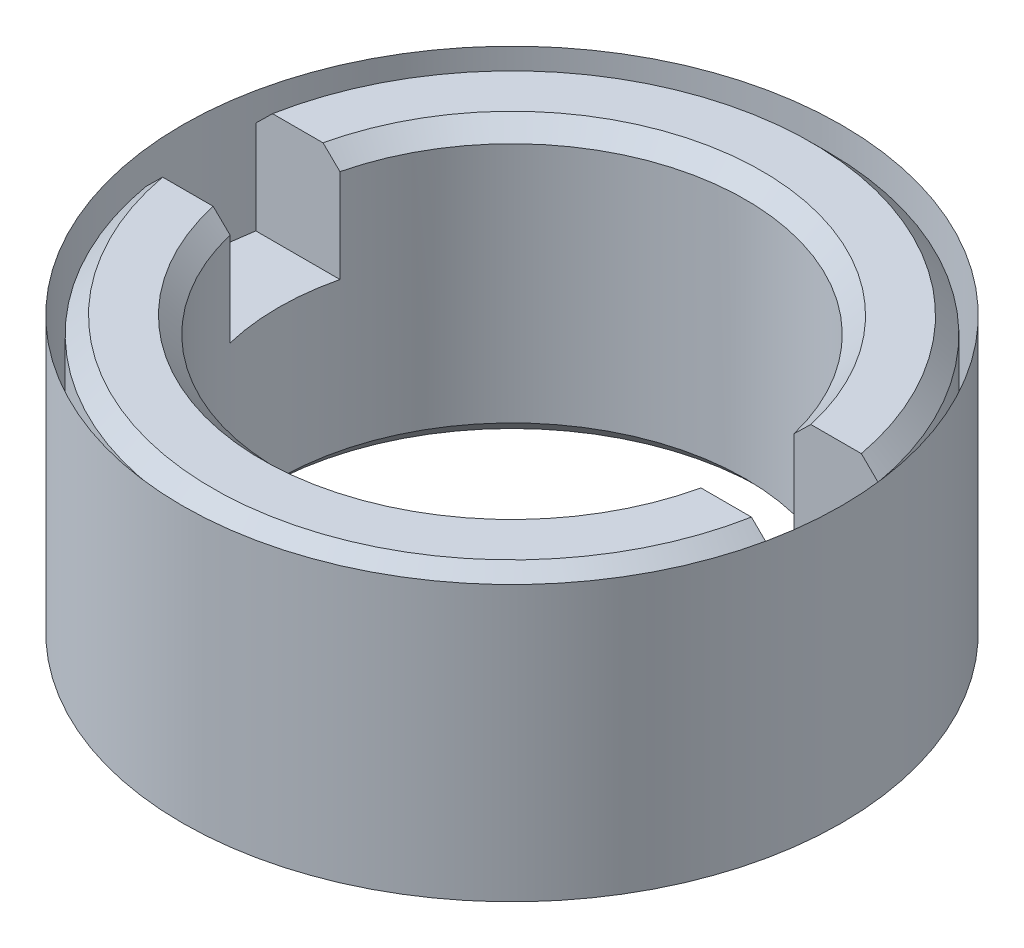
ISO-10303-21;
HEADER;
FILE_DESCRIPTION(('STEP AP214'),'2;1');
FILE_NAME('part.step','',(''),(''),'','','');
FILE_SCHEMA(('AUTOMOTIVE_DESIGN { 1 0 10303 214 1 1 1 1 }'));
ENDSEC;
DATA;
#1=APPLICATION_CONTEXT('core data for automotive mechanical design processes');
#2=APPLICATION_PROTOCOL_DEFINITION('international standard','automotive_design',2000,#1);
#3=PRODUCT_CONTEXT('',#1,'mechanical');
#4=PRODUCT('Part','Part','',(#3));
#5=PRODUCT_RELATED_PRODUCT_CATEGORY('part','',(#4));
#6=PRODUCT_DEFINITION_FORMATION('','',#4);
#7=PRODUCT_DEFINITION_CONTEXT('part definition',#1,'design');
#8=PRODUCT_DEFINITION('design','',#6,#7);
#9=PRODUCT_DEFINITION_SHAPE('','',#8);
#10=(LENGTH_UNIT() NAMED_UNIT(*) SI_UNIT(.MILLI.,.METRE.));
#11=(NAMED_UNIT(*) PLANE_ANGLE_UNIT() SI_UNIT($,.RADIAN.));
#12=(NAMED_UNIT(*) SI_UNIT($,.STERADIAN.) SOLID_ANGLE_UNIT());
#13=UNCERTAINTY_MEASURE_WITH_UNIT(LENGTH_MEASURE(1.E-05),#10,'distance_accuracy_value','');
#14=(GEOMETRIC_REPRESENTATION_CONTEXT(3) GLOBAL_UNCERTAINTY_ASSIGNED_CONTEXT((#13)) GLOBAL_UNIT_ASSIGNED_CONTEXT((#10,
#11,#12)) REPRESENTATION_CONTEXT('',''));
#15=CARTESIAN_POINT('',(0.,0.,0.));
#16=DIRECTION('',(0.,0.,1.));
#17=DIRECTION('',(1.,0.,0.));
#18=AXIS2_PLACEMENT_3D('',#15,#16,#17);
#19=CARTESIAN_POINT('',(0.,4.99999999982492,0.));
#20=DIRECTION('',(0.,1.,0.));
#21=DIRECTION('',(0.,0.,1.));
#22=AXIS2_PLACEMENT_3D('',#19,#20,#21);
#23=CONICAL_SURFACE('',#22,4.54999999982419,0.785398163397448);
#24=CARTESIAN_POINT('',(-4.13067791047438,4.70000000001026,-1.));
#25=CARTESIAN_POINT('',(-4.18206969356389,4.74995228641139,-1.));
#26=CARTESIAN_POINT('',(-4.23343824475705,4.79992842979507,-1.));
#27=CARTESIAN_POINT('',(-4.33612888259486,4.8999284297915,-1.));
#28=CARTESIAN_POINT('',(-4.3874509692402,4.94995228640355,-1.));
#29=CARTESIAN_POINT('',(-4.43874982398988,4.99999999999745,-1.));
#30=B_SPLINE_CURVE_WITH_KNOTS('',3,(#24,#25,#26,#27,#28,#29),.UNSPECIFIED.,.F.,.F.,(4,2,4),(0.,
0.215004852579448,0.430009701993997),.UNSPECIFIED.);
#31=CARTESIAN_POINT('',(-4.13067791047137,4.70000000000732,-0.999999999999952));
#32=VERTEX_POINT('',#31);
#33=CARTESIAN_POINT('',(-4.43874982398885,4.99999999999645,-1.));
#34=VERTEX_POINT('',#33);
#35=EDGE_CURVE('P0_E179',#32,#34,#30,.T.);
#36=ORIENTED_EDGE('',*,*,#35,.F.);
#37=CARTESIAN_POINT('',(0.,4.70000000001392,0.));
#38=DIRECTION('',(0.,1.,0.));
#39=DIRECTION('',(0.,0.,-1.));
#40=AXIS2_PLACEMENT_3D('',#37,#38,#39);
#41=CIRCLE('',#40,4.25000000001319);
#42=CARTESIAN_POINT('',(4.13067791047036,4.70000000001293,-0.999999999999952));
#43=VERTEX_POINT('',#42);
#44=EDGE_CURVE('P0_E177',#43,#32,#41,.T.);
#45=ORIENTED_EDGE('',*,*,#44,.F.);
#46=CARTESIAN_POINT('',(4.43874982398988,4.99999999999745,-1.));
#47=CARTESIAN_POINT('',(4.38745096924049,4.94995228640384,-1.));
#48=CARTESIAN_POINT('',(4.33612888259544,4.89992842979207,-1.));
#49=CARTESIAN_POINT('',(4.23343824475821,4.7999284297962,-1.));
#50=CARTESIAN_POINT('',(4.18206969356534,4.7499522864128,-1.));
#51=CARTESIAN_POINT('',(4.13067791047612,4.70000000001195,-1.));
#52=B_SPLINE_CURVE_WITH_KNOTS('',3,(#46,#47,#48,#49,#50,#51),.UNSPECIFIED.,.F.,.F.,(4,2,4),(0.,
0.215004849413337,0.430009701991573),.UNSPECIFIED.);
#53=CARTESIAN_POINT('',(4.43874982398885,4.99999999999645,-1.));
#54=VERTEX_POINT('',#53);
#55=EDGE_CURVE('P0_E20',#54,#43,#52,.T.);
#56=ORIENTED_EDGE('',*,*,#55,.F.);
#57=CARTESIAN_POINT('',(0.,4.99999999999545,0.));
#58=DIRECTION('',(0.,1.,0.));
#59=DIRECTION('',(0.,0.,1.));
#60=AXIS2_PLACEMENT_3D('',#57,#58,#59);
#61=CIRCLE('',#60,4.54999999999472);
#62=EDGE_CURVE('P0_E167',#34,#54,#61,.F.);
#63=ORIENTED_EDGE('',*,*,#62,.F.);
#64=EDGE_LOOP('',(#36,#45,#56,#63));
#65=FACE_BOUND('',#64,.T.);
#66=ADVANCED_FACE('P0_F16',(#65),#23,.F.);
#67=CARTESIAN_POINT('',(0.,0.,0.));
#68=DIRECTION('',(0.,1.,0.));
#69=DIRECTION('',(0.,0.,1.));
#70=AXIS2_PLACEMENT_3D('',#67,#68,#69);
#71=CYLINDRICAL_SURFACE('',#70,4.25);
#72=CARTESIAN_POINT('',(0.,0.300000000038381,0.));
#73=DIRECTION('',(0.,-1.,0.));
#74=DIRECTION('',(0.,0.,-1.));
#75=AXIS2_PLACEMENT_3D('',#72,#73,#74);
#76=CIRCLE('',#75,4.25000000001319);
#77=CARTESIAN_POINT('',(0.,0.300000000038381,-4.25000000001319));
#78=VERTEX_POINT('',#77);
#79=EDGE_CURVE('P0_E174',#78,#78,#76,.T.);
#80=ORIENTED_EDGE('',*,*,#79,.T.);
#81=EDGE_LOOP('',(#80));
#82=FACE_BOUND('',#81,.T.);
#83=CARTESIAN_POINT('',(0.,4.70000000001392,0.));
#84=DIRECTION('',(0.,1.,0.));
#85=DIRECTION('',(0.,0.,-1.));
#86=AXIS2_PLACEMENT_3D('',#83,#84,#85);
#87=CIRCLE('',#86,4.25000000001319);
#88=CARTESIAN_POINT('',(-4.13067791047036,4.70000000001293,0.999999999999951));
#89=VERTEX_POINT('',#88);
#90=CARTESIAN_POINT('',(4.13067791047137,4.70000000000732,0.999999999999952));
#91=VERTEX_POINT('',#90);
#92=EDGE_CURVE('P0_E168',#89,#91,#87,.T.);
#93=ORIENTED_EDGE('',*,*,#92,.T.);
#94=DIRECTION('',(0.,1.,0.));
#95=VECTOR('',#94,1.);
#96=CARTESIAN_POINT('',(4.1306779104646,0.,0.999999999999904));
#97=LINE('',#96,#95);
#98=CARTESIAN_POINT('',(4.13067791046459,3.,0.999999999999952));
#99=VERTEX_POINT('',#98);
#100=EDGE_CURVE('P0_E119',#99,#91,#97,.T.);
#101=ORIENTED_EDGE('',*,*,#100,.F.);
#102=CARTESIAN_POINT('',(0.,3.,0.));
#103=DIRECTION('',(0.,1.,0.));
#104=DIRECTION('',(0.,0.,1.));
#105=AXIS2_PLACEMENT_3D('',#102,#103,#104);
#106=CIRCLE('',#105,4.25);
#107=CARTESIAN_POINT('',(4.13067791046459,3.,-0.999999999999952));
#108=VERTEX_POINT('',#107);
#109=EDGE_CURVE('P0_E112',#108,#99,#106,.F.);
#110=ORIENTED_EDGE('',*,*,#109,.F.);
#111=DIRECTION('',(0.,1.,0.));
#112=VECTOR('',#111,1.);
#113=CARTESIAN_POINT('',(4.1306779104646,0.,-0.999999999999903));
#114=LINE('',#113,#112);
#115=EDGE_CURVE('P0_E117',#43,#108,#114,.F.);
#116=ORIENTED_EDGE('',*,*,#115,.F.);
#117=ORIENTED_EDGE('',*,*,#44,.T.);
#118=DIRECTION('',(0.,1.,0.));
#119=VECTOR('',#118,1.);
#120=CARTESIAN_POINT('',(-4.1306779104646,0.,-0.999999999999904));
#121=LINE('',#120,#119);
#122=CARTESIAN_POINT('',(-4.13067791046459,3.,-0.999999999999952));
#123=VERTEX_POINT('',#122);
#124=EDGE_CURVE('P0_E131',#123,#32,#121,.T.);
#125=ORIENTED_EDGE('',*,*,#124,.F.);
#126=CARTESIAN_POINT('',(0.,3.,0.));
#127=DIRECTION('',(0.,1.,0.));
#128=DIRECTION('',(0.,0.,1.));
#129=AXIS2_PLACEMENT_3D('',#126,#127,#128);
#130=CIRCLE('',#129,4.25);
#131=CARTESIAN_POINT('',(-4.13067791046459,3.,0.999999999999951));
#132=VERTEX_POINT('',#131);
#133=EDGE_CURVE('P0_E106',#132,#123,#130,.F.);
#134=ORIENTED_EDGE('',*,*,#133,.F.);
#135=DIRECTION('',(0.,1.,0.));
#136=VECTOR('',#135,1.);
#137=CARTESIAN_POINT('',(-4.1306779104646,0.,0.999999999999903));
#138=LINE('',#137,#136);
#139=EDGE_CURVE('P0_E172',#89,#132,#138,.F.);
#140=ORIENTED_EDGE('',*,*,#139,.F.);
#141=EDGE_LOOP('',(#93,#101,#110,#116,#117,#125,#134,#140));
#142=FACE_BOUND('',#141,.T.);
#143=ADVANCED_FACE('P0_F115',(#82,#142),#71,.F.);
#144=CARTESIAN_POINT('',(0.,0.,0.));
#145=DIRECTION('',(0.,-1.,0.));
#146=DIRECTION('',(0.,0.,-1.));
#147=AXIS2_PLACEMENT_3D('',#144,#145,#146);
#148=CONICAL_SURFACE('',#147,4.55000000005157,0.785398163397448);
#149=ORIENTED_EDGE('',*,*,#79,.F.);
#150=EDGE_LOOP('',(#149));
#151=FACE_BOUND('',#150,.T.);
#152=CARTESIAN_POINT('',(0.,0.,0.));
#153=DIRECTION('',(0.,-1.,0.));
#154=DIRECTION('',(0.,0.,-1.));
#155=AXIS2_PLACEMENT_3D('',#152,#153,#154);
#156=CIRCLE('',#155,4.55000000005157);
#157=CARTESIAN_POINT('',(0.,0.,-4.55000000005157));
#158=VERTEX_POINT('',#157);
#159=EDGE_CURVE('P0_E218',#158,#158,#156,.T.);
#160=ORIENTED_EDGE('',*,*,#159,.T.);
#161=EDGE_LOOP('',(#160));
#162=FACE_BOUND('',#161,.T.);
#163=ADVANCED_FACE('P0_F236',(#151,#162),#148,.F.);
#164=CARTESIAN_POINT('',(0.,5.,0.));
#165=DIRECTION('',(0.,1.,0.));
#166=DIRECTION('',(0.,0.,1.));
#167=AXIS2_PLACEMENT_3D('',#164,#165,#166);
#168=PLANE('',#167);
#169=CARTESIAN_POINT('',(0.,4.99999999999545,0.));
#170=DIRECTION('',(0.,-1.,0.));
#171=DIRECTION('',(0.,0.,-1.));
#172=AXIS2_PLACEMENT_3D('',#169,#170,#171);
#173=CIRCLE('',#172,5.45000000005302);
#174=CARTESIAN_POINT('',(-5.35747141854748,4.99999999999773,-1.));
#175=VERTEX_POINT('',#174);
#176=CARTESIAN_POINT('',(5.35747141854748,4.99999999999773,-1.));
#177=VERTEX_POINT('',#176);
#178=EDGE_CURVE('P0_E282',#175,#177,#173,.T.);
#179=ORIENTED_EDGE('',*,*,#178,.F.);
#180=DIRECTION('',(1.,0.,0.));
#181=VECTOR('',#180,1.);
#182=CARTESIAN_POINT('',(0.,5.,-1.));
#183=LINE('',#182,#181);
#184=EDGE_CURVE('P0_E161',#175,#34,#183,.T.);
#185=ORIENTED_EDGE('',*,*,#184,.T.);
#186=ORIENTED_EDGE('',*,*,#62,.T.);
#187=DIRECTION('',(1.,0.,0.));
#188=VECTOR('',#187,1.);
#189=CARTESIAN_POINT('',(0.,5.,-1.));
#190=LINE('',#189,#188);
#191=EDGE_CURVE('P0_E165',#54,#177,#190,.T.);
#192=ORIENTED_EDGE('',*,*,#191,.T.);
#193=EDGE_LOOP('',(#179,#185,#186,#192));
#194=FACE_BOUND('',#193,.T.);
#195=ADVANCED_FACE('P0_F230',(#194),#168,.T.);
#196=CARTESIAN_POINT('',(0.,4.99999999982492,0.));
#197=DIRECTION('',(0.,1.,0.));
#198=DIRECTION('',(0.,0.,1.));
#199=AXIS2_PLACEMENT_3D('',#196,#197,#198);
#200=CONICAL_SURFACE('',#199,4.54999999982419,0.785398163397448);
#201=CARTESIAN_POINT('',(4.13067791047438,4.70000000001026,1.));
#202=CARTESIAN_POINT('',(4.18206969356389,4.74995228641139,1.));
#203=CARTESIAN_POINT('',(4.23343824475705,4.79992842979507,1.));
#204=CARTESIAN_POINT('',(4.33612888259486,4.8999284297915,1.));
#205=CARTESIAN_POINT('',(4.3874509692402,4.94995228640355,1.));
#206=CARTESIAN_POINT('',(4.43874982398988,4.99999999999745,1.));
#207=B_SPLINE_CURVE_WITH_KNOTS('',3,(#201,#202,#203,#204,#205,#206),.UNSPECIFIED.,.F.,.F.,(4,2,
4),(0.,0.215004852579449,0.430009701993998),.UNSPECIFIED.);
#208=CARTESIAN_POINT('',(4.43874982398885,4.99999999999645,1.));
#209=VERTEX_POINT('',#208);
#210=EDGE_CURVE('P0_E170',#91,#209,#207,.T.);
#211=ORIENTED_EDGE('',*,*,#210,.F.);
#212=ORIENTED_EDGE('',*,*,#92,.F.);
#213=CARTESIAN_POINT('',(-4.43874982398988,4.99999999999745,1.));
#214=CARTESIAN_POINT('',(-4.38745096924049,4.94995228640384,1.));
#215=CARTESIAN_POINT('',(-4.33612888259544,4.89992842979207,1.));
#216=CARTESIAN_POINT('',(-4.23343824475821,4.7999284297962,1.));
#217=CARTESIAN_POINT('',(-4.18206969356534,4.7499522864128,1.));
#218=CARTESIAN_POINT('',(-4.13067791047612,4.70000000001195,1.));
#219=B_SPLINE_CURVE_WITH_KNOTS('',3,(#213,#214,#215,#216,#217,#218),.UNSPECIFIED.,.F.,.F.,(4,2,
4),(0.,0.215004849413337,0.430009701991573),.UNSPECIFIED.);
#220=CARTESIAN_POINT('',(-4.43874982398885,4.99999999999645,1.));
#221=VERTEX_POINT('',#220);
#222=EDGE_CURVE('P0_E164',#221,#89,#219,.T.);
#223=ORIENTED_EDGE('',*,*,#222,.F.);
#224=CARTESIAN_POINT('',(0.,4.99999999999545,0.));
#225=DIRECTION('',(0.,1.,0.));
#226=DIRECTION('',(0.,0.,1.));
#227=AXIS2_PLACEMENT_3D('',#224,#225,#226);
#228=CIRCLE('',#227,4.54999999999472);
#229=EDGE_CURVE('P0_E157',#209,#221,#228,.F.);
#230=ORIENTED_EDGE('',*,*,#229,.F.);
#231=EDGE_LOOP('',(#211,#212,#223,#230));
#232=FACE_BOUND('',#231,.T.);
#233=ADVANCED_FACE('P0_F224',(#232),#200,.F.);
#234=CARTESIAN_POINT('',(0.,0.,0.));
#235=DIRECTION('',(0.,1.,0.));
#236=DIRECTION('',(0.,0.,1.));
#237=AXIS2_PLACEMENT_3D('',#234,#235,#236);
#238=PLANE('',#237);
#239=ORIENTED_EDGE('',*,*,#159,.F.);
#240=EDGE_LOOP('',(#239));
#241=FACE_BOUND('',#240,.T.);
#242=CARTESIAN_POINT('',(0.,0.,0.));
#243=DIRECTION('',(0.,1.,0.));
#244=DIRECTION('',(0.,0.,1.));
#245=AXIS2_PLACEMENT_3D('',#242,#243,#244);
#246=CIRCLE('',#245,5.44999999993932);
#247=CARTESIAN_POINT('',(0.,0.,5.44999999993931));
#248=VERTEX_POINT('',#247);
#249=EDGE_CURVE('P0_E153',#248,#248,#246,.T.);
#250=ORIENTED_EDGE('',*,*,#249,.F.);
#251=EDGE_LOOP('',(#250));
#252=FACE_BOUND('',#251,.T.);
#253=ADVANCED_FACE('P0_F229',(#241,#252),#238,.F.);
#254=CARTESIAN_POINT('',(0.,4.70000000018445,0.));
#255=DIRECTION('',(0.,-1.,0.));
#256=DIRECTION('',(0.,0.,-1.));
#257=AXIS2_PLACEMENT_3D('',#254,#255,#256);
#258=CONICAL_SURFACE('',#257,5.74999999986403,0.785398163397448);
#259=CARTESIAN_POINT('',(0.,4.7,0.));
#260=DIRECTION('',(0.,1.,0.));
#261=DIRECTION('',(0.,0.,1.));
#262=AXIS2_PLACEMENT_3D('',#259,#260,#261);
#263=CIRCLE('',#262,5.75);
#264=CARTESIAN_POINT('',(-5.66237582646517,4.70000000001231,-1.00000000000001));
#265=VERTEX_POINT('',#264);
#266=CARTESIAN_POINT('',(5.66237582646518,4.70000000001231,-1.00000000000001));
#267=VERTEX_POINT('',#266);
#268=EDGE_CURVE('P0_E142',#265,#267,#263,.F.);
#269=ORIENTED_EDGE('',*,*,#268,.F.);
#270=CARTESIAN_POINT('',(-5.66237582647728,4.70000000002463,-1.));
#271=CARTESIAN_POINT('',(-5.61158049596436,4.75002243151758,-1.));
#272=CARTESIAN_POINT('',(-5.56077413007846,4.80003364723098,-1.));
#273=CARTESIAN_POINT('',(-5.45913932742806,4.90003364722915,-1.));
#274=CARTESIAN_POINT('',(-5.4083108906635,4.95002243151385,-1.));
#275=CARTESIAN_POINT('',(-5.35747141852591,5.00000000001894,-1.));
#276=B_SPLINE_CURVE_WITH_KNOTS('',3,(#270,#271,#272,#273,#274,#275),.UNSPECIFIED.,.F.,.F.,(4,2,
4),(0.,0.213873038518141,0.427746077594405),.UNSPECIFIED.);
#277=EDGE_CURVE('P0_E156',#265,#175,#276,.T.);
#278=ORIENTED_EDGE('',*,*,#277,.T.);
#279=ORIENTED_EDGE('',*,*,#178,.T.);
#280=CARTESIAN_POINT('',(5.35747141852591,5.00000000001894,-1.));
#281=CARTESIAN_POINT('',(5.40831089066351,4.95002243151385,-1.));
#282=CARTESIAN_POINT('',(5.45913932742806,4.90003364722914,-1.));
#283=CARTESIAN_POINT('',(5.56077413007847,4.80003364723097,-1.));
#284=CARTESIAN_POINT('',(5.61158049596438,4.75002243151757,-1.));
#285=CARTESIAN_POINT('',(5.6623758264773,4.70000000002461,-1.));
#286=B_SPLINE_CURVE_WITH_KNOTS('',3,(#280,#281,#282,#283,#284,#285),.UNSPECIFIED.,.F.,.F.,(4,2,
4),(0.,0.213873039076274,0.427746077594427),.UNSPECIFIED.);
#287=EDGE_CURVE('P0_E280',#177,#267,#286,.T.);
#288=ORIENTED_EDGE('',*,*,#287,.T.);
#289=EDGE_LOOP('',(#269,#278,#279,#288));
#290=FACE_BOUND('',#289,.T.);
#291=ADVANCED_FACE('P0_F295',(#290),#258,.T.);
#292=CARTESIAN_POINT('',(6.959756831924,5.,-1.));
#293=DIRECTION('',(0.,0.,-1.));
#294=DIRECTION('',(-1.,0.,0.));
#295=AXIS2_PLACEMENT_3D('',#292,#293,#294);
#296=PLANE('',#295);
#297=ORIENTED_EDGE('',*,*,#115,.T.);
#298=DIRECTION('',(1.,0.,0.));
#299=VECTOR('',#298,1.);
#300=CARTESIAN_POINT('',(0.,3.,-1.));
#301=LINE('',#300,#299);
#302=CARTESIAN_POINT('',(5.66237582645306,3.,-1.00000000000001));
#303=VERTEX_POINT('',#302);
#304=EDGE_CURVE('P0_E128',#303,#108,#301,.F.);
#305=ORIENTED_EDGE('',*,*,#304,.F.);
#306=DIRECTION('',(0.,1.,0.));
#307=VECTOR('',#306,1.);
#308=CARTESIAN_POINT('',(5.66237582645306,0.,-1.00000000000001));
#309=LINE('',#308,#307);
#310=EDGE_CURVE('P0_E137',#267,#303,#309,.F.);
#311=ORIENTED_EDGE('',*,*,#310,.F.);
#312=ORIENTED_EDGE('',*,*,#287,.F.);
#313=ORIENTED_EDGE('',*,*,#191,.F.);
#314=ORIENTED_EDGE('',*,*,#55,.T.);
#315=EDGE_LOOP('',(#297,#305,#311,#312,#313,#314));
#316=FACE_BOUND('',#315,.T.);
#317=ADVANCED_FACE('P0_F126',(#316),#296,.F.);
#318=CARTESIAN_POINT('',(0.,5.,0.));
#319=DIRECTION('',(0.,1.,0.));
#320=DIRECTION('',(0.,0.,1.));
#321=AXIS2_PLACEMENT_3D('',#318,#319,#320);
#322=PLANE('',#321);
#323=ORIENTED_EDGE('',*,*,#229,.T.);
#324=DIRECTION('',(1.,0.,0.));
#325=VECTOR('',#324,1.);
#326=CARTESIAN_POINT('',(0.,5.,1.));
#327=LINE('',#326,#325);
#328=CARTESIAN_POINT('',(-5.35747141854747,4.99999999999773,1.));
#329=VERTEX_POINT('',#328);
#330=EDGE_CURVE('P0_E155',#221,#329,#327,.F.);
#331=ORIENTED_EDGE('',*,*,#330,.T.);
#332=CARTESIAN_POINT('',(0.,4.99999999999545,0.));
#333=DIRECTION('',(0.,-1.,0.));
#334=DIRECTION('',(0.,0.,-1.));
#335=AXIS2_PLACEMENT_3D('',#332,#333,#334);
#336=CIRCLE('',#335,5.45000000005301);
#337=CARTESIAN_POINT('',(5.35747141854747,4.99999999999773,1.));
#338=VERTEX_POINT('',#337);
#339=EDGE_CURVE('P0_E272',#338,#329,#336,.T.);
#340=ORIENTED_EDGE('',*,*,#339,.F.);
#341=DIRECTION('',(1.,0.,0.));
#342=VECTOR('',#341,1.);
#343=CARTESIAN_POINT('',(-7.012884746671,5.,1.));
#344=LINE('',#343,#342);
#345=EDGE_CURVE('P0_E136',#338,#209,#344,.F.);
#346=ORIENTED_EDGE('',*,*,#345,.T.);
#347=EDGE_LOOP('',(#323,#331,#340,#346));
#348=FACE_BOUND('',#347,.T.);
#349=ADVANCED_FACE('P0_F278',(#348),#322,.T.);
#350=CARTESIAN_POINT('',(6.959756831924,5.,-1.));
#351=DIRECTION('',(0.,0.,-1.));
#352=DIRECTION('',(-1.,0.,0.));
#353=AXIS2_PLACEMENT_3D('',#350,#351,#352);
#354=PLANE('',#353);
#355=DIRECTION('',(0.,1.,0.));
#356=VECTOR('',#355,1.);
#357=CARTESIAN_POINT('',(-5.66237582645306,0.,-1.00000000000001));
#358=LINE('',#357,#356);
#359=CARTESIAN_POINT('',(-5.66237582645306,3.,-1.00000000000001));
#360=VERTEX_POINT('',#359);
#361=EDGE_CURVE('P0_E151',#360,#265,#358,.T.);
#362=ORIENTED_EDGE('',*,*,#361,.F.);
#363=DIRECTION('',(1.,0.,0.));
#364=VECTOR('',#363,1.);
#365=CARTESIAN_POINT('',(0.,3.,-1.));
#366=LINE('',#365,#364);
#367=EDGE_CURVE('P0_E150',#123,#360,#366,.F.);
#368=ORIENTED_EDGE('',*,*,#367,.F.);
#369=ORIENTED_EDGE('',*,*,#124,.T.);
#370=ORIENTED_EDGE('',*,*,#35,.T.);
#371=ORIENTED_EDGE('',*,*,#184,.F.);
#372=ORIENTED_EDGE('',*,*,#277,.F.);
#373=EDGE_LOOP('',(#362,#368,#369,#370,#371,#372));
#374=FACE_BOUND('',#373,.T.);
#375=ADVANCED_FACE('P0_F310',(#374),#354,.F.);
#376=CARTESIAN_POINT('',(0.,0.299999999924694,0.));
#377=DIRECTION('',(0.,1.,0.));
#378=DIRECTION('',(0.,0.,1.));
#379=AXIS2_PLACEMENT_3D('',#376,#377,#378);
#380=CONICAL_SURFACE('',#379,5.74999999986402,0.785398163397448);
#381=CARTESIAN_POINT('',(0.,0.3,0.));
#382=DIRECTION('',(0.,1.,0.));
#383=DIRECTION('',(0.,0.,1.));
#384=AXIS2_PLACEMENT_3D('',#381,#382,#383);
#385=CIRCLE('',#384,5.75);
#386=CARTESIAN_POINT('',(0.,0.3,5.75));
#387=VERTEX_POINT('',#386);
#388=EDGE_CURVE('P0_E147',#387,#387,#385,.T.);
#389=ORIENTED_EDGE('',*,*,#388,.F.);
#390=EDGE_LOOP('',(#389));
#391=FACE_BOUND('',#390,.T.);
#392=ORIENTED_EDGE('',*,*,#249,.T.);
#393=EDGE_LOOP('',(#392));
#394=FACE_BOUND('',#393,.T.);
#395=ADVANCED_FACE('P0_F319',(#391,#394),#380,.T.);
#396=CARTESIAN_POINT('',(0.,3.,0.));
#397=DIRECTION('',(0.,1.,0.));
#398=DIRECTION('',(0.,0.,1.));
#399=AXIS2_PLACEMENT_3D('',#396,#397,#398);
#400=PLANE('',#399);
#401=CARTESIAN_POINT('',(0.,3.,0.));
#402=DIRECTION('',(0.,1.,0.));
#403=DIRECTION('',(0.,0.,1.));
#404=AXIS2_PLACEMENT_3D('',#401,#402,#403);
#405=CIRCLE('',#404,5.75);
#406=CARTESIAN_POINT('',(5.66237582645306,3.,1.00000000000001));
#407=VERTEX_POINT('',#406);
#408=EDGE_CURVE('P0_E135',#303,#407,#405,.F.);
#409=ORIENTED_EDGE('',*,*,#408,.F.);
#410=ORIENTED_EDGE('',*,*,#304,.T.);
#411=ORIENTED_EDGE('',*,*,#109,.T.);
#412=DIRECTION('',(1.,0.,0.));
#413=VECTOR('',#412,1.);
#414=CARTESIAN_POINT('',(-7.012884746671,3.,1.));
#415=LINE('',#414,#413);
#416=EDGE_CURVE('P0_E140',#99,#407,#415,.T.);
#417=ORIENTED_EDGE('',*,*,#416,.T.);
#418=EDGE_LOOP('',(#409,#410,#411,#417));
#419=FACE_BOUND('',#418,.T.);
#420=ADVANCED_FACE('P0_F133',(#419),#400,.T.);
#421=CARTESIAN_POINT('',(-7.012884746671,5.,1.));
#422=DIRECTION('',(0.,0.,1.));
#423=DIRECTION('',(1.,0.,0.));
#424=AXIS2_PLACEMENT_3D('',#421,#422,#423);
#425=PLANE('',#424);
#426=DIRECTION('',(0.,1.,0.));
#427=VECTOR('',#426,1.);
#428=CARTESIAN_POINT('',(5.66237582645306,0.,1.00000000000001));
#429=LINE('',#428,#427);
#430=CARTESIAN_POINT('',(5.66237582646065,4.70000000001676,1.00000000000001));
#431=VERTEX_POINT('',#430);
#432=EDGE_CURVE('P0_E182',#407,#431,#429,.T.);
#433=ORIENTED_EDGE('',*,*,#432,.F.);
#434=ORIENTED_EDGE('',*,*,#416,.F.);
#435=ORIENTED_EDGE('',*,*,#100,.T.);
#436=ORIENTED_EDGE('',*,*,#210,.T.);
#437=ORIENTED_EDGE('',*,*,#345,.F.);
#438=CARTESIAN_POINT('',(5.66237582646824,4.70000000003352,1.));
#439=CARTESIAN_POINT('',(5.61158049595918,4.75002243152268,1.));
#440=CARTESIAN_POINT('',(5.56077413007713,4.80003364723228,1.));
#441=CARTESIAN_POINT('',(5.45913932743445,4.90003364722284,1.));
#442=CARTESIAN_POINT('',(5.40831089067376,4.95002243150375,1.));
#443=CARTESIAN_POINT('',(5.35747141854002,5.00000000000505,1.));
#444=B_SPLINE_CURVE_WITH_KNOTS('',3,(#438,#439,#440,#441,#442,#443),.UNSPECIFIED.,.F.,.F.,(4,2,
4),(0.,0.213873038501898,0.427746077561919),.UNSPECIFIED.);
#445=EDGE_CURVE('P0_E190',#431,#338,#444,.T.);
#446=ORIENTED_EDGE('',*,*,#445,.F.);
#447=EDGE_LOOP('',(#433,#434,#435,#436,#437,#446));
#448=FACE_BOUND('',#447,.T.);
#449=ADVANCED_FACE('P0_F202',(#448),#425,.F.);
#450=CARTESIAN_POINT('',(0.,4.70000000018445,0.));
#451=DIRECTION('',(0.,-1.,0.));
#452=DIRECTION('',(0.,0.,-1.));
#453=AXIS2_PLACEMENT_3D('',#450,#451,#452);
#454=CONICAL_SURFACE('',#453,5.74999999986402,0.785398163397448);
#455=CARTESIAN_POINT('',(0.,4.7,0.));
#456=DIRECTION('',(0.,1.,0.));
#457=DIRECTION('',(0.,0.,1.));
#458=AXIS2_PLACEMENT_3D('',#455,#456,#457);
#459=CIRCLE('',#458,5.75);
#460=CARTESIAN_POINT('',(-5.66237582646517,4.7000000000123,1.));
#461=VERTEX_POINT('',#460);
#462=EDGE_CURVE('P0_E262',#431,#461,#459,.F.);
#463=ORIENTED_EDGE('',*,*,#462,.F.);
#464=ORIENTED_EDGE('',*,*,#445,.T.);
#465=ORIENTED_EDGE('',*,*,#339,.T.);
#466=CARTESIAN_POINT('',(-5.3574714185259,5.00000000001893,1.));
#467=CARTESIAN_POINT('',(-5.4083108906635,4.95002243151384,1.));
#468=CARTESIAN_POINT('',(-5.45913932742805,4.90003364722913,1.));
#469=CARTESIAN_POINT('',(-5.56077413007846,4.80003364723097,1.));
#470=CARTESIAN_POINT('',(-5.61158049596437,4.75002243151756,1.));
#471=CARTESIAN_POINT('',(-5.66237582647729,4.7000000000246,1.));
#472=B_SPLINE_CURVE_WITH_KNOTS('',3,(#466,#467,#468,#469,#470,#471),.UNSPECIFIED.,.F.,.F.,(4,2,
4),(0.,0.213873039076276,0.42774607759443),.UNSPECIFIED.);
#473=EDGE_CURVE('P0_E183',#329,#461,#472,.T.);
#474=ORIENTED_EDGE('',*,*,#473,.T.);
#475=EDGE_LOOP('',(#463,#464,#465,#474));
#476=FACE_BOUND('',#475,.T.);
#477=ADVANCED_FACE('P0_F199',(#476),#454,.T.);
#478=CARTESIAN_POINT('',(-7.012884746671,5.,1.));
#479=DIRECTION('',(0.,0.,1.));
#480=DIRECTION('',(1.,0.,0.));
#481=AXIS2_PLACEMENT_3D('',#478,#479,#480);
#482=PLANE('',#481);
#483=ORIENTED_EDGE('',*,*,#139,.T.);
#484=DIRECTION('',(1.,0.,0.));
#485=VECTOR('',#484,1.);
#486=CARTESIAN_POINT('',(0.,3.,1.));
#487=LINE('',#486,#485);
#488=CARTESIAN_POINT('',(-5.66237582645306,3.,1.));
#489=VERTEX_POINT('',#488);
#490=EDGE_CURVE('P0_E39',#489,#132,#487,.T.);
#491=ORIENTED_EDGE('',*,*,#490,.F.);
#492=DIRECTION('',(0.,1.,0.));
#493=VECTOR('',#492,1.);
#494=CARTESIAN_POINT('',(-5.66237582645306,0.,1.00000000000001));
#495=LINE('',#494,#493);
#496=EDGE_CURVE('P0_E30',#461,#489,#495,.F.);
#497=ORIENTED_EDGE('',*,*,#496,.F.);
#498=ORIENTED_EDGE('',*,*,#473,.F.);
#499=ORIENTED_EDGE('',*,*,#330,.F.);
#500=ORIENTED_EDGE('',*,*,#222,.T.);
#501=EDGE_LOOP('',(#483,#491,#497,#498,#499,#500));
#502=FACE_BOUND('',#501,.T.);
#503=ADVANCED_FACE('P0_F196',(#502),#482,.F.);
#504=CARTESIAN_POINT('',(0.,3.,0.));
#505=DIRECTION('',(0.,1.,0.));
#506=DIRECTION('',(0.,0.,1.));
#507=AXIS2_PLACEMENT_3D('',#504,#505,#506);
#508=PLANE('',#507);
#509=ORIENTED_EDGE('',*,*,#367,.T.);
#510=CARTESIAN_POINT('',(0.,3.,0.));
#511=DIRECTION('',(0.,1.,0.));
#512=DIRECTION('',(0.,0.,1.));
#513=AXIS2_PLACEMENT_3D('',#510,#511,#512);
#514=CIRCLE('',#513,5.75);
#515=EDGE_CURVE('P0_E11',#489,#360,#514,.F.);
#516=ORIENTED_EDGE('',*,*,#515,.F.);
#517=ORIENTED_EDGE('',*,*,#490,.T.);
#518=ORIENTED_EDGE('',*,*,#133,.T.);
#519=EDGE_LOOP('',(#509,#516,#517,#518));
#520=FACE_BOUND('',#519,.T.);
#521=ADVANCED_FACE('P0_F249',(#520),#508,.T.);
#522=CARTESIAN_POINT('',(0.,0.,0.));
#523=DIRECTION('',(0.,1.,0.));
#524=DIRECTION('',(0.,0.,1.));
#525=AXIS2_PLACEMENT_3D('',#522,#523,#524);
#526=CYLINDRICAL_SURFACE('',#525,5.75);
#527=ORIENTED_EDGE('',*,*,#388,.T.);
#528=EDGE_LOOP('',(#527));
#529=FACE_BOUND('',#528,.T.);
#530=ORIENTED_EDGE('',*,*,#496,.T.);
#531=ORIENTED_EDGE('',*,*,#515,.T.);
#532=ORIENTED_EDGE('',*,*,#361,.T.);
#533=ORIENTED_EDGE('',*,*,#268,.T.);
#534=ORIENTED_EDGE('',*,*,#310,.T.);
#535=ORIENTED_EDGE('',*,*,#408,.T.);
#536=ORIENTED_EDGE('',*,*,#432,.T.);
#537=ORIENTED_EDGE('',*,*,#462,.T.);
#538=EDGE_LOOP('',(#530,#531,#532,#533,#534,#535,#536,#537));
#539=FACE_BOUND('',#538,.T.);
#540=ADVANCED_FACE('P0_F247',(#529,#539),#526,.T.);
#541=CLOSED_SHELL('',(#66,#143,#163,#195,#233,#253,#291,#317,#349,#375,#395,#420,#449,#477,#503,
#521,#540));
#542=MANIFOLD_SOLID_BREP('P0_B1',#541);
#543=CARTESIAN_POINT('',(0.,5.,0.));
#544=DIRECTION('',(0.,1.,0.));
#545=DIRECTION('',(0.,0.,1.));
#546=AXIS2_PLACEMENT_3D('',#543,#544,#545);
#547=CYLINDRICAL_SURFACE('',#546,6.);
#548=CARTESIAN_POINT('',(0.,0.,0.));
#549=DIRECTION('',(0.,1.,0.));
#550=DIRECTION('',(0.,0.,1.));
#551=AXIS2_PLACEMENT_3D('',#548,#549,#550);
#552=CIRCLE('',#551,6.);
#553=CARTESIAN_POINT('',(0.,0.,6.));
#554=VERTEX_POINT('',#553);
#555=EDGE_CURVE('P1_E20',#554,#554,#552,.T.);
#556=ORIENTED_EDGE('',*,*,#555,.T.);
#557=EDGE_LOOP('',(#556));
#558=FACE_BOUND('',#557,.T.);
#559=CARTESIAN_POINT('',(0.,5.,0.));
#560=DIRECTION('',(0.,1.,0.));
#561=DIRECTION('',(0.,0.,1.));
#562=AXIS2_PLACEMENT_3D('',#559,#560,#561);
#563=CIRCLE('',#562,6.);
#564=CARTESIAN_POINT('',(0.,5.,6.));
#565=VERTEX_POINT('',#564);
#566=EDGE_CURVE('P1_E11',#565,#565,#563,.F.);
#567=ORIENTED_EDGE('',*,*,#566,.T.);
#568=EDGE_LOOP('',(#567));
#569=FACE_BOUND('',#568,.T.);
#570=ADVANCED_FACE('P1_F16',(#558,#569),#547,.T.);
#571=CARTESIAN_POINT('',(0.,0.,0.));
#572=DIRECTION('',(0.,1.,0.));
#573=DIRECTION('',(0.,0.,1.));
#574=AXIS2_PLACEMENT_3D('',#571,#572,#573);
#575=PLANE('',#574);
#576=CARTESIAN_POINT('',(5.45,0.,0.));
#577=CARTESIAN_POINT('',(5.44900425438651,0.,1.08628422771378));
#578=CARTESIAN_POINT('',(5.03513684200147,0.,2.08565557085254));
#579=CARTESIAN_POINT('',(4.82995019189741,0.,2.58112260201337));
#580=CARTESIAN_POINT('',(4.53150826379232,0.,3.02785966773732));
#581=CARTESIAN_POINT('',(4.23364088520665,0.,3.47373669154941));
#582=CARTESIAN_POINT('',(3.85372788666122,0.,3.85372661284812));
#583=CARTESIAN_POINT('',(3.4746122511627,0.,4.23291900965411));
#584=CARTESIAN_POINT('',(3.02785696828743,0.,4.53150862945502));
#585=CARTESIAN_POINT('',(2.58203311112664,0.,4.82947572936502));
#586=CARTESIAN_POINT('',(2.08562367170085,0.,5.03514029116827));
#587=CARTESIAN_POINT('',(1.59021439616489,0.,5.24039048077834));
#588=CARTESIAN_POINT('',(1.06324106208223,0.,5.34527469588416));
#589=CARTESIAN_POINT('',(0.537337235922063,0.,5.44994604538228));
#590=CARTESIAN_POINT('',(0.,0.,5.44999999999968));
#591=CARTESIAN_POINT('',(-0.536244153951804,0.,5.45005384485953));
#592=CARTESIAN_POINT('',(-1.06324106208223,0.,5.34527469588416));
#593=CARTESIAN_POINT('',(-1.58916402864379,0.,5.24070907128037));
#594=CARTESIAN_POINT('',(-2.08562367170085,0.,5.03514029116827));
#595=CARTESIAN_POINT('',(-2.58106484343407,0.,4.82999322893506));
#596=CARTESIAN_POINT('',(-3.02785696828743,0.,4.53150862945502));
#597=CARTESIAN_POINT('',(-3.47376367456052,0.,4.2336155440049));
#598=CARTESIAN_POINT('',(-3.85372788666122,0.,3.85372661284812));
#599=CARTESIAN_POINT('',(-4.23294426466915,0.,3.47458536761844));
#600=CARTESIAN_POINT('',(-4.53150826379232,0.,3.02785966773731));
#601=CARTESIAN_POINT('',(-4.82943235467932,0.,2.58209142908896));
#602=CARTESIAN_POINT('',(-5.03513684200146,0.,2.08565557085258));
#603=CARTESIAN_POINT('',(-5.24031110386309,0.,1.59049932948297));
#604=CARTESIAN_POINT('',(-5.34530042571904,0.,1.0630016795253));
#605=CARTESIAN_POINT('',(-5.44950551686156,0.,0.539444238448382));
#606=CARTESIAN_POINT('',(-5.45,0.,0.));
#607=B_SPLINE_CURVE_WITH_KNOTS('',2,(#576,#577,#578,#579,#580,#581,#582,#583,#584,#585,#586,
#587,#588,#589,#590,#591,#592,#593,#594,#595,#596,#597,#598,#599,#600,#601,#602,#603,#604,#605,
#606),.UNSPECIFIED.,.F.,.F.,(3,2,2,2,2,2,2,2,2,2,2,2,2,2,2,3),(0.,0.125,0.1875,0.25,0.3125,
0.375,0.4375,0.5,0.5625,0.625,0.6875,0.75,0.8125,0.875,0.9375,1.),.UNSPECIFIED.);
#608=CARTESIAN_POINT('',(5.45,0.,0.));
#609=VERTEX_POINT('',#608);
#610=CARTESIAN_POINT('',(-5.45,0.,0.));
#611=VERTEX_POINT('',#610);
#612=EDGE_CURVE('P1_E28',#609,#611,#607,.T.);
#613=ORIENTED_EDGE('',*,*,#612,.F.);
#614=CARTESIAN_POINT('',(-5.45,0.,0.));
#615=CARTESIAN_POINT('',(-5.44900425438651,0.,-1.08628422771378));
#616=CARTESIAN_POINT('',(-5.03513684200147,0.,-2.08565557085254));
#617=CARTESIAN_POINT('',(-4.82995019189741,0.,-2.58112260201337));
#618=CARTESIAN_POINT('',(-4.53150826379232,0.,-3.02785966773732));
#619=CARTESIAN_POINT('',(-4.23364088520665,0.,-3.47373669154941));
#620=CARTESIAN_POINT('',(-3.85372788666122,0.,-3.85372661284812));
#621=CARTESIAN_POINT('',(-3.4746122511627,0.,-4.23291900965411));
#622=CARTESIAN_POINT('',(-3.02785696828743,0.,-4.53150862945502));
#623=CARTESIAN_POINT('',(-2.58203311112664,0.,-4.82947572936502));
#624=CARTESIAN_POINT('',(-2.08562367170085,0.,-5.03514029116827));
#625=CARTESIAN_POINT('',(-1.59021439616489,0.,-5.24039048077834));
#626=CARTESIAN_POINT('',(-1.06324106208223,0.,-5.34527469588416));
#627=CARTESIAN_POINT('',(-0.537337235922063,0.,-5.44994604538228));
#628=CARTESIAN_POINT('',(0.,0.,-5.44999999999968));
#629=CARTESIAN_POINT('',(0.536244153951804,0.,-5.45005384485953));
#630=CARTESIAN_POINT('',(1.06324106208223,0.,-5.34527469588416));
#631=CARTESIAN_POINT('',(1.58916402864379,0.,-5.24070907128037));
#632=CARTESIAN_POINT('',(2.08562367170085,0.,-5.03514029116827));
#633=CARTESIAN_POINT('',(2.58106484343407,0.,-4.82999322893506));
#634=CARTESIAN_POINT('',(3.02785696828743,0.,-4.53150862945502));
#635=CARTESIAN_POINT('',(3.47376367456052,0.,-4.2336155440049));
#636=CARTESIAN_POINT('',(3.85372788666122,0.,-3.85372661284812));
#637=CARTESIAN_POINT('',(4.23294426466915,0.,-3.47458536761844));
#638=CARTESIAN_POINT('',(4.53150826379232,0.,-3.02785966773731));
#639=CARTESIAN_POINT('',(4.82943235467932,0.,-2.58209142908896));
#640=CARTESIAN_POINT('',(5.03513684200146,0.,-2.08565557085258));
#641=CARTESIAN_POINT('',(5.24031110386309,0.,-1.59049932948297));
#642=CARTESIAN_POINT('',(5.34530042571904,0.,-1.0630016795253));
#643=CARTESIAN_POINT('',(5.44950551686156,0.,-0.539444238448382));
#644=CARTESIAN_POINT('',(5.45,0.,0.));
#645=B_SPLINE_CURVE_WITH_KNOTS('',2,(#614,#615,#616,#617,#618,#619,#620,#621,#622,#623,#624,
#625,#626,#627,#628,#629,#630,#631,#632,#633,#634,#635,#636,#637,#638,#639,#640,#641,#642,#643,
#644),.UNSPECIFIED.,.F.,.F.,(3,2,2,2,2,2,2,2,2,2,2,2,2,2,2,3),(0.,0.125,0.1875,0.25,0.3125,
0.375,0.4375,0.5,0.5625,0.625,0.6875,0.75,0.8125,0.875,0.9375,1.),.UNSPECIFIED.);
#646=EDGE_CURVE('P1_E33',#611,#609,#645,.T.);
#647=ORIENTED_EDGE('',*,*,#646,.F.);
#648=EDGE_LOOP('',(#613,#647));
#649=FACE_BOUND('',#648,.T.);
#650=ORIENTED_EDGE('',*,*,#555,.F.);
#651=EDGE_LOOP('',(#650));
#652=FACE_BOUND('',#651,.T.);
#653=ADVANCED_FACE('P1_F17',(#649,#652),#575,.F.);
#654=OPEN_SHELL('',(#570,#653));
#655=SHELL_BASED_SURFACE_MODEL('P1_B1',(#654));
#656=ADVANCED_BREP_SHAPE_REPRESENTATION('',(#18,#542),#14);
#657=MANIFOLD_SURFACE_SHAPE_REPRESENTATION('',(#18,#655),#14);
#658=SHAPE_REPRESENTATION('',(#18),#14);
#659=SHAPE_DEFINITION_REPRESENTATION(#9,#658);
#660=SHAPE_REPRESENTATION_RELATIONSHIP('','',#658,#656);
#661=SHAPE_REPRESENTATION_RELATIONSHIP('','',#658,#657);
ENDSEC;
END-ISO-10303-21;
